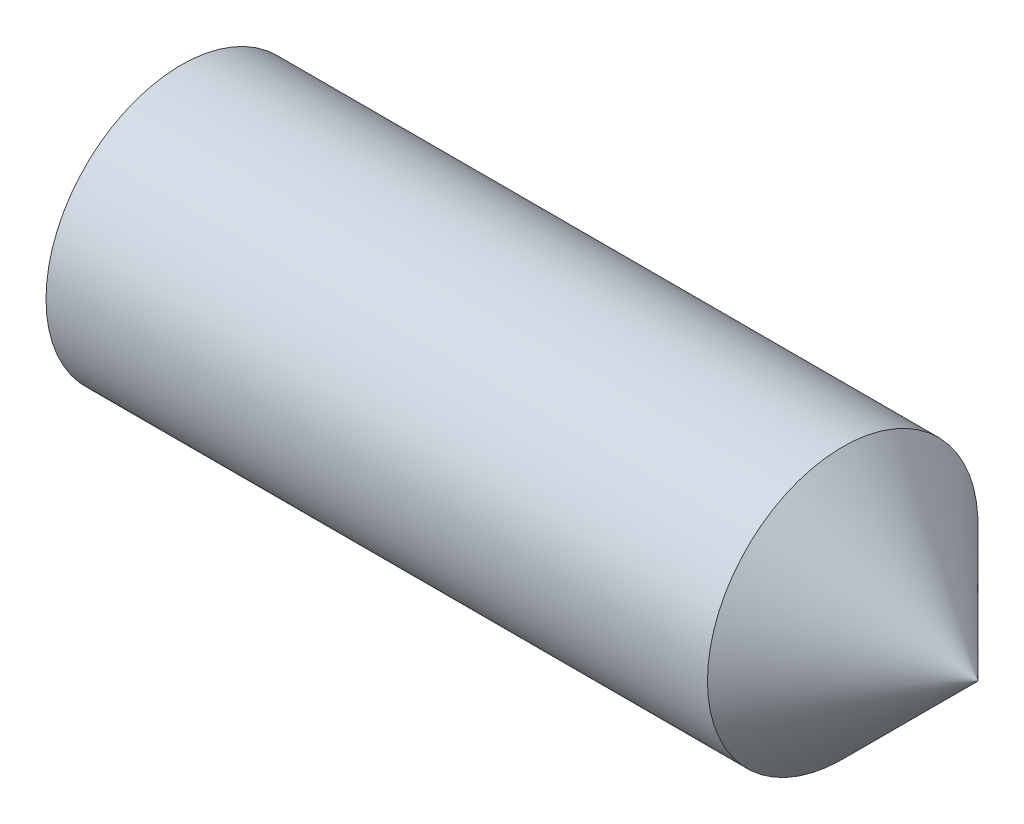
ISO-10303-21;
HEADER;
FILE_DESCRIPTION(('STEP AP214'),'2;1');
FILE_NAME('part.step','',(''),(''),'','','');
FILE_SCHEMA(('AUTOMOTIVE_DESIGN { 1 0 10303 214 1 1 1 1 }'));
ENDSEC;
DATA;
#1=APPLICATION_CONTEXT('core data for automotive mechanical design processes');
#2=APPLICATION_PROTOCOL_DEFINITION('international standard','automotive_design',2000,#1);
#3=PRODUCT_CONTEXT('',#1,'mechanical');
#4=PRODUCT('Part','Part','',(#3));
#5=PRODUCT_RELATED_PRODUCT_CATEGORY('part','',(#4));
#6=PRODUCT_DEFINITION_FORMATION('','',#4);
#7=PRODUCT_DEFINITION_CONTEXT('part definition',#1,'design');
#8=PRODUCT_DEFINITION('design','',#6,#7);
#9=PRODUCT_DEFINITION_SHAPE('','',#8);
#10=(LENGTH_UNIT() NAMED_UNIT(*) SI_UNIT(.MILLI.,.METRE.));
#11=(NAMED_UNIT(*) PLANE_ANGLE_UNIT() SI_UNIT($,.RADIAN.));
#12=(NAMED_UNIT(*) SI_UNIT($,.STERADIAN.) SOLID_ANGLE_UNIT());
#13=UNCERTAINTY_MEASURE_WITH_UNIT(LENGTH_MEASURE(1.E-05),#10,'distance_accuracy_value','');
#14=(GEOMETRIC_REPRESENTATION_CONTEXT(3) GLOBAL_UNCERTAINTY_ASSIGNED_CONTEXT((#13)) GLOBAL_UNIT_ASSIGNED_CONTEXT((#10,
#11,#12)) REPRESENTATION_CONTEXT('',''));
#15=CARTESIAN_POINT('',(0.,0.,0.));
#16=DIRECTION('',(0.,0.,1.));
#17=DIRECTION('',(1.,0.,0.));
#18=AXIS2_PLACEMENT_3D('',#15,#16,#17);
#19=CARTESIAN_POINT('',(0.,0.,0.));
#20=DIRECTION('',(-1.,0.,0.));
#21=DIRECTION('',(0.,0.,1.));
#22=AXIS2_PLACEMENT_3D('',#19,#20,#21);
#23=PLANE('',#22);
#24=CARTESIAN_POINT('',(0.,0.,0.));
#25=DIRECTION('',(-1.,0.,0.));
#26=DIRECTION('',(0.,0.,1.));
#27=AXIS2_PLACEMENT_3D('',#24,#25,#26);
#28=CIRCLE('',#27,1.61);
#29=CARTESIAN_POINT('',(0.,0.,1.61));
#30=VERTEX_POINT('',#29);
#31=EDGE_CURVE('E137',#30,#30,#28,.T.);
#32=ORIENTED_EDGE('',*,*,#31,.T.);
#33=EDGE_LOOP('',(#32));
#34=FACE_BOUND('',#33,.T.);
#35=DIRECTION('',(0.,0.,-1.));
#36=VECTOR('',#35,1.);
#37=CARTESIAN_POINT('',(0.,1.,0.577350269189623));
#38=LINE('',#37,#36);
#39=CARTESIAN_POINT('',(0.,1.,0.577350269189623));
#40=VERTEX_POINT('',#39);
#41=CARTESIAN_POINT('',(0.,1.,-0.577350269189628));
#42=VERTEX_POINT('',#41);
#43=EDGE_CURVE('E128',#40,#42,#38,.T.);
#44=ORIENTED_EDGE('',*,*,#43,.F.);
#45=DIRECTION('',(0.,-0.866025403784438,0.500000000000001));
#46=VECTOR('',#45,1.);
#47=CARTESIAN_POINT('',(0.,1.,0.577350269189623));
#48=LINE('',#47,#46);
#49=CARTESIAN_POINT('',(0.,0.,1.15470053837925));
#50=VERTEX_POINT('',#49);
#51=EDGE_CURVE('E50',#40,#50,#48,.T.);
#52=ORIENTED_EDGE('',*,*,#51,.T.);
#53=DIRECTION('',(0.,0.866025403784439,0.5));
#54=VECTOR('',#53,1.);
#55=CARTESIAN_POINT('',(0.,-0.999999999999996,0.577350269189624));
#56=LINE('',#55,#54);
#57=CARTESIAN_POINT('',(0.,-0.999999999999996,0.577350269189624));
#58=VERTEX_POINT('',#57);
#59=EDGE_CURVE('E119',#58,#50,#56,.T.);
#60=ORIENTED_EDGE('',*,*,#59,.F.);
#61=DIRECTION('',(0.,0.,-1.));
#62=VECTOR('',#61,1.);
#63=CARTESIAN_POINT('',(0.,-0.999999999999996,0.577350269189624));
#64=LINE('',#63,#62);
#65=CARTESIAN_POINT('',(0.,-0.999999999999996,-0.577350269189627));
#66=VERTEX_POINT('',#65);
#67=EDGE_CURVE('E122',#58,#66,#64,.T.);
#68=ORIENTED_EDGE('',*,*,#67,.T.);
#69=DIRECTION('',(0.,0.866025403784438,-0.500000000000001));
#70=VECTOR('',#69,1.);
#71=CARTESIAN_POINT('',(0.,-0.999999999999996,-0.577350269189627));
#72=LINE('',#71,#70);
#73=CARTESIAN_POINT('',(0.,0.,-1.15470053837925));
#74=VERTEX_POINT('',#73);
#75=EDGE_CURVE('E125',#66,#74,#72,.T.);
#76=ORIENTED_EDGE('',*,*,#75,.T.);
#77=DIRECTION('',(0.,-0.866025403784438,-0.5));
#78=VECTOR('',#77,1.);
#79=CARTESIAN_POINT('',(0.,1.,-0.577350269189628));
#80=LINE('',#79,#78);
#81=EDGE_CURVE('E108',#42,#74,#80,.T.);
#82=ORIENTED_EDGE('',*,*,#81,.F.);
#83=EDGE_LOOP('',(#44,#52,#60,#68,#76,#82));
#84=FACE_BOUND('',#83,.T.);
#85=ADVANCED_FACE('F35',(#34,#84),#23,.T.);
#86=CARTESIAN_POINT('',(12.,0.005,0.));
#87=DIRECTION('',(1.,0.,0.));
#88=DIRECTION('',(0.,0.,-1.));
#89=AXIS2_PLACEMENT_3D('',#86,#87,#88);
#90=PLANE('',#89);
#91=CARTESIAN_POINT('',(12.,0.,0.));
#92=DIRECTION('',(-1.,0.,0.));
#93=DIRECTION('',(0.,0.,1.));
#94=AXIS2_PLACEMENT_3D('',#91,#92,#93);
#95=CIRCLE('',#94,0.005);
#96=CARTESIAN_POINT('',(12.,0.,0.005));
#97=VERTEX_POINT('',#96);
#98=EDGE_CURVE('E11',#97,#97,#95,.T.);
#99=ORIENTED_EDGE('',*,*,#98,.F.);
#100=EDGE_LOOP('',(#99));
#101=FACE_BOUND('',#100,.T.);
#102=ADVANCED_FACE('F37',(#101),#90,.T.);
#103=CARTESIAN_POINT('',(10.005,0.,0.));
#104=DIRECTION('',(-1.,0.,0.));
#105=DIRECTION('',(0.,0.,1.));
#106=AXIS2_PLACEMENT_3D('',#103,#104,#105);
#107=CONICAL_SURFACE('',#106,2.,0.785398163397447);
#108=ORIENTED_EDGE('',*,*,#98,.T.);
#109=EDGE_LOOP('',(#108));
#110=FACE_BOUND('',#109,.T.);
#111=CARTESIAN_POINT('',(10.005,0.,0.));
#112=DIRECTION('',(-1.,0.,0.));
#113=DIRECTION('',(0.,0.,1.));
#114=AXIS2_PLACEMENT_3D('',#111,#112,#113);
#115=CIRCLE('',#114,2.);
#116=CARTESIAN_POINT('',(10.005,0.,2.));
#117=VERTEX_POINT('',#116);
#118=EDGE_CURVE('E43',#117,#117,#115,.T.);
#119=ORIENTED_EDGE('',*,*,#118,.F.);
#120=EDGE_LOOP('',(#119));
#121=FACE_BOUND('',#120,.T.);
#122=ADVANCED_FACE('F148',(#110,#121),#107,.T.);
#123=CARTESIAN_POINT('',(-12.7,0.,0.));
#124=DIRECTION('',(-1.,0.,0.));
#125=DIRECTION('',(0.,0.,1.));
#126=AXIS2_PLACEMENT_3D('',#123,#124,#125);
#127=CYLINDRICAL_SURFACE('',#126,2.);
#128=ORIENTED_EDGE('',*,*,#118,.T.);
#129=EDGE_LOOP('',(#128));
#130=FACE_BOUND('',#129,.T.);
#131=CARTESIAN_POINT('',(0.225166604983952,0.,0.));
#132=DIRECTION('',(-1.,0.,0.));
#133=DIRECTION('',(0.,0.,1.));
#134=AXIS2_PLACEMENT_3D('',#131,#132,#133);
#135=CIRCLE('',#134,2.);
#136=CARTESIAN_POINT('',(0.225166604983952,0.,2.));
#137=VERTEX_POINT('',#136);
#138=EDGE_CURVE('E140',#137,#137,#135,.T.);
#139=ORIENTED_EDGE('',*,*,#138,.F.);
#140=EDGE_LOOP('',(#139));
#141=FACE_BOUND('',#140,.T.);
#142=ADVANCED_FACE('F145',(#130,#141),#127,.T.);
#143=CARTESIAN_POINT('',(0.,0.,0.));
#144=DIRECTION('',(1.,0.,0.));
#145=DIRECTION('',(0.,0.,-1.));
#146=AXIS2_PLACEMENT_3D('',#143,#144,#145);
#147=CONICAL_SURFACE('',#146,1.61,1.0471975511966);
#148=ORIENTED_EDGE('',*,*,#138,.T.);
#149=EDGE_LOOP('',(#148));
#150=FACE_BOUND('',#149,.T.);
#151=ORIENTED_EDGE('',*,*,#31,.F.);
#152=EDGE_LOOP('',(#151));
#153=FACE_BOUND('',#152,.T.);
#154=ADVANCED_FACE('F155',(#150,#153),#147,.T.);
#155=CARTESIAN_POINT('',(2.5,1.,0.577350269189623));
#156=DIRECTION('',(0.,-0.500000000000001,-0.866025403784438));
#157=DIRECTION('',(0.,0.866025403784438,-0.500000000000001));
#158=AXIS2_PLACEMENT_3D('',#155,#156,#157);
#159=PLANE('',#158);
#160=ORIENTED_EDGE('',*,*,#51,.F.);
#161=DIRECTION('',(-1.,0.,0.));
#162=VECTOR('',#161,1.);
#163=CARTESIAN_POINT('',(2.5,1.,0.577350269189623));
#164=LINE('',#163,#162);
#165=CARTESIAN_POINT('',(2.5,1.,0.577350269189623));
#166=VERTEX_POINT('',#165);
#167=EDGE_CURVE('E55',#166,#40,#164,.T.);
#168=ORIENTED_EDGE('',*,*,#167,.F.);
#169=DIRECTION('',(0.,-0.866025403784438,0.500000000000001));
#170=VECTOR('',#169,1.);
#171=CARTESIAN_POINT('',(2.5,1.,0.577350269189623));
#172=LINE('',#171,#170);
#173=CARTESIAN_POINT('',(2.5,0.,1.15470053837925));
#174=VERTEX_POINT('',#173);
#175=EDGE_CURVE('E82',#166,#174,#172,.T.);
#176=ORIENTED_EDGE('',*,*,#175,.T.);
#177=DIRECTION('',(-1.,0.,0.));
#178=VECTOR('',#177,1.);
#179=CARTESIAN_POINT('',(2.5,0.,1.15470053837925));
#180=LINE('',#179,#178);
#181=EDGE_CURVE('E135',#174,#50,#180,.T.);
#182=ORIENTED_EDGE('',*,*,#181,.T.);
#183=EDGE_LOOP('',(#160,#168,#176,#182));
#184=FACE_BOUND('',#183,.T.);
#185=ADVANCED_FACE('F166',(#184),#159,.T.);
#186=CARTESIAN_POINT('',(2.5,-0.999999999999996,0.577350269189624));
#187=DIRECTION('',(0.,-0.5,0.866025403784439));
#188=DIRECTION('',(0.,-0.866025403784439,-0.5));
#189=AXIS2_PLACEMENT_3D('',#186,#187,#188);
#190=PLANE('',#189);
#191=ORIENTED_EDGE('',*,*,#59,.T.);
#192=ORIENTED_EDGE('',*,*,#181,.F.);
#193=DIRECTION('',(0.,0.866025403784439,0.5));
#194=VECTOR('',#193,1.);
#195=CARTESIAN_POINT('',(2.5,-0.999999999999996,0.577350269189624));
#196=LINE('',#195,#194);
#197=CARTESIAN_POINT('',(2.5,-0.999999999999996,0.577350269189624));
#198=VERTEX_POINT('',#197);
#199=EDGE_CURVE('E266',#198,#174,#196,.T.);
#200=ORIENTED_EDGE('',*,*,#199,.F.);
#201=DIRECTION('',(-1.,0.,0.));
#202=VECTOR('',#201,1.);
#203=CARTESIAN_POINT('',(2.5,-0.999999999999996,0.577350269189624));
#204=LINE('',#203,#202);
#205=EDGE_CURVE('E133',#198,#58,#204,.T.);
#206=ORIENTED_EDGE('',*,*,#205,.T.);
#207=EDGE_LOOP('',(#191,#192,#200,#206));
#208=FACE_BOUND('',#207,.T.);
#209=ADVANCED_FACE('F173',(#208),#190,.F.);
#210=CARTESIAN_POINT('',(2.5,-0.999999999999996,0.577350269189624));
#211=DIRECTION('',(0.,1.,0.));
#212=DIRECTION('',(0.,0.,1.));
#213=AXIS2_PLACEMENT_3D('',#210,#211,#212);
#214=PLANE('',#213);
#215=ORIENTED_EDGE('',*,*,#67,.F.);
#216=ORIENTED_EDGE('',*,*,#205,.F.);
#217=DIRECTION('',(0.,0.,-1.));
#218=VECTOR('',#217,1.);
#219=CARTESIAN_POINT('',(2.5,-0.999999999999996,0.577350269189624));
#220=LINE('',#219,#218);
#221=CARTESIAN_POINT('',(2.5,-0.999999999999996,-0.577350269189627));
#222=VERTEX_POINT('',#221);
#223=EDGE_CURVE('E103',#198,#222,#220,.T.);
#224=ORIENTED_EDGE('',*,*,#223,.T.);
#225=DIRECTION('',(-1.,0.,0.));
#226=VECTOR('',#225,1.);
#227=CARTESIAN_POINT('',(2.5,-0.999999999999996,-0.577350269189627));
#228=LINE('',#227,#226);
#229=EDGE_CURVE('E98',#222,#66,#228,.T.);
#230=ORIENTED_EDGE('',*,*,#229,.T.);
#231=EDGE_LOOP('',(#215,#216,#224,#230));
#232=FACE_BOUND('',#231,.T.);
#233=ADVANCED_FACE('F180',(#232),#214,.T.);
#234=CARTESIAN_POINT('',(2.5,-0.999999999999996,-0.577350269189627));
#235=DIRECTION('',(0.,0.500000000000001,0.866025403784438));
#236=DIRECTION('',(0.,-0.866025403784438,0.500000000000001));
#237=AXIS2_PLACEMENT_3D('',#234,#235,#236);
#238=PLANE('',#237);
#239=ORIENTED_EDGE('',*,*,#75,.F.);
#240=ORIENTED_EDGE('',*,*,#229,.F.);
#241=DIRECTION('',(0.,0.866025403784438,-0.500000000000001));
#242=VECTOR('',#241,1.);
#243=CARTESIAN_POINT('',(2.5,-0.999999999999996,-0.577350269189627));
#244=LINE('',#243,#242);
#245=CARTESIAN_POINT('',(2.5,0.,-1.15470053837925));
#246=VERTEX_POINT('',#245);
#247=EDGE_CURVE('E93',#222,#246,#244,.T.);
#248=ORIENTED_EDGE('',*,*,#247,.T.);
#249=DIRECTION('',(-1.,0.,0.));
#250=VECTOR('',#249,1.);
#251=CARTESIAN_POINT('',(2.5,0.,-1.15470053837925));
#252=LINE('',#251,#250);
#253=EDGE_CURVE('E97',#246,#74,#252,.T.);
#254=ORIENTED_EDGE('',*,*,#253,.T.);
#255=EDGE_LOOP('',(#239,#240,#248,#254));
#256=FACE_BOUND('',#255,.T.);
#257=ADVANCED_FACE('F96',(#256),#238,.T.);
#258=CARTESIAN_POINT('',(2.5,1.,-0.577350269189628));
#259=DIRECTION('',(0.,0.5,-0.866025403784439));
#260=DIRECTION('',(0.,0.866025403784439,0.5));
#261=AXIS2_PLACEMENT_3D('',#258,#259,#260);
#262=PLANE('',#261);
#263=ORIENTED_EDGE('',*,*,#81,.T.);
#264=ORIENTED_EDGE('',*,*,#253,.F.);
#265=DIRECTION('',(0.,-0.866025403784438,-0.5));
#266=VECTOR('',#265,1.);
#267=CARTESIAN_POINT('',(2.5,1.,-0.577350269189628));
#268=LINE('',#267,#266);
#269=CARTESIAN_POINT('',(2.5,1.,-0.577350269189628));
#270=VERTEX_POINT('',#269);
#271=EDGE_CURVE('E102',#270,#246,#268,.T.);
#272=ORIENTED_EDGE('',*,*,#271,.F.);
#273=DIRECTION('',(-1.,0.,0.));
#274=VECTOR('',#273,1.);
#275=CARTESIAN_POINT('',(2.5,1.,-0.577350269189628));
#276=LINE('',#275,#274);
#277=EDGE_CURVE('E78',#270,#42,#276,.T.);
#278=ORIENTED_EDGE('',*,*,#277,.T.);
#279=EDGE_LOOP('',(#263,#264,#272,#278));
#280=FACE_BOUND('',#279,.T.);
#281=ADVANCED_FACE('F105',(#280),#262,.F.);
#282=CARTESIAN_POINT('',(2.5,1.,0.577350269189623));
#283=DIRECTION('',(0.,1.,0.));
#284=DIRECTION('',(0.,0.,1.));
#285=AXIS2_PLACEMENT_3D('',#282,#283,#284);
#286=PLANE('',#285);
#287=ORIENTED_EDGE('',*,*,#43,.T.);
#288=ORIENTED_EDGE('',*,*,#277,.F.);
#289=DIRECTION('',(0.,0.,-1.));
#290=VECTOR('',#289,1.);
#291=CARTESIAN_POINT('',(2.5,1.,0.577350269189623));
#292=LINE('',#291,#290);
#293=EDGE_CURVE('E113',#166,#270,#292,.T.);
#294=ORIENTED_EDGE('',*,*,#293,.F.);
#295=ORIENTED_EDGE('',*,*,#167,.T.);
#296=EDGE_LOOP('',(#287,#288,#294,#295));
#297=FACE_BOUND('',#296,.T.);
#298=ADVANCED_FACE('F192',(#297),#286,.F.);
#299=CARTESIAN_POINT('',(2.5,2.,0.));
#300=DIRECTION('',(1.,0.,0.));
#301=DIRECTION('',(0.,0.,-1.));
#302=AXIS2_PLACEMENT_3D('',#299,#300,#301);
#303=PLANE('',#302);
#304=ORIENTED_EDGE('',*,*,#175,.F.);
#305=ORIENTED_EDGE('',*,*,#293,.T.);
#306=ORIENTED_EDGE('',*,*,#271,.T.);
#307=ORIENTED_EDGE('',*,*,#247,.F.);
#308=ORIENTED_EDGE('',*,*,#223,.F.);
#309=ORIENTED_EDGE('',*,*,#199,.T.);
#310=EDGE_LOOP('',(#304,#305,#306,#307,#308,#309));
#311=FACE_BOUND('',#310,.T.);
#312=ADVANCED_FACE('F111',(#311),#303,.F.);
#313=CLOSED_SHELL('',(#85,#102,#122,#142,#154,#185,#209,#233,#257,#281,#298,#312));
#314=MANIFOLD_SOLID_BREP('B2',#313);
#315=ADVANCED_BREP_SHAPE_REPRESENTATION('',(#18,#314),#14);
#316=SHAPE_DEFINITION_REPRESENTATION(#9,#315);
ENDSEC;
END-ISO-10303-21;
